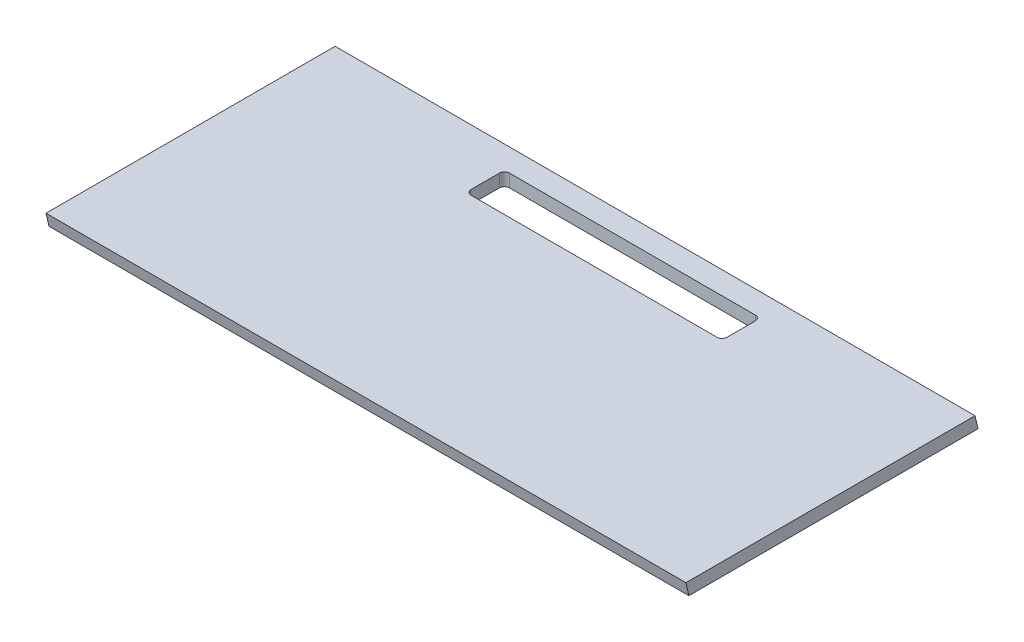
ISO-10303-21;
HEADER;
FILE_DESCRIPTION(('STEP AP214'),'2;1');
FILE_NAME('part.step','',(''),(''),'','','');
FILE_SCHEMA(('AUTOMOTIVE_DESIGN { 1 0 10303 214 1 1 1 1 }'));
ENDSEC;
DATA;
#1=APPLICATION_CONTEXT('core data for automotive mechanical design processes');
#2=APPLICATION_PROTOCOL_DEFINITION('international standard','automotive_design',2000,#1);
#3=PRODUCT_CONTEXT('',#1,'mechanical');
#4=PRODUCT('Part','Part','',(#3));
#5=PRODUCT_RELATED_PRODUCT_CATEGORY('part','',(#4));
#6=PRODUCT_DEFINITION_FORMATION('','',#4);
#7=PRODUCT_DEFINITION_CONTEXT('part definition',#1,'design');
#8=PRODUCT_DEFINITION('design','',#6,#7);
#9=PRODUCT_DEFINITION_SHAPE('','',#8);
#10=(LENGTH_UNIT() NAMED_UNIT(*) SI_UNIT(.MILLI.,.METRE.));
#11=(NAMED_UNIT(*) PLANE_ANGLE_UNIT() SI_UNIT($,.RADIAN.));
#12=(NAMED_UNIT(*) SI_UNIT($,.STERADIAN.) SOLID_ANGLE_UNIT());
#13=UNCERTAINTY_MEASURE_WITH_UNIT(LENGTH_MEASURE(1.E-05),#10,'distance_accuracy_value','');
#14=(GEOMETRIC_REPRESENTATION_CONTEXT(3) GLOBAL_UNCERTAINTY_ASSIGNED_CONTEXT((#13)) GLOBAL_UNIT_ASSIGNED_CONTEXT((#10,
#11,#12)) REPRESENTATION_CONTEXT('',''));
#15=CARTESIAN_POINT('',(0.,0.,0.));
#16=DIRECTION('',(0.,0.,1.));
#17=DIRECTION('',(1.,0.,0.));
#18=AXIS2_PLACEMENT_3D('',#15,#16,#17);
#19=CARTESIAN_POINT('',(250.,10.,114.1));
#20=DIRECTION('',(-1.,0.,0.));
#21=DIRECTION('',(0.,0.,1.));
#22=AXIS2_PLACEMENT_3D('',#19,#20,#21);
#23=PLANE('',#22);
#24=DIRECTION('',(0.,0.,-1.));
#25=VECTOR('',#24,1.);
#26=CARTESIAN_POINT('',(250.,10.,114.1));
#27=LINE('',#26,#25);
#28=CARTESIAN_POINT('',(250.,10.,114.1));
#29=VERTEX_POINT('',#28);
#30=CARTESIAN_POINT('',(250.,10.,-111.791318088744));
#31=VERTEX_POINT('',#30);
#32=EDGE_CURVE('E138',#29,#31,#27,.T.);
#33=ORIENTED_EDGE('',*,*,#32,.F.);
#34=DIRECTION('',(0.,0.974370064785237,0.224951054343859));
#35=VECTOR('',#34,1.);
#36=CARTESIAN_POINT('',(250.,10.,114.1));
#37=LINE('',#36,#35);
#38=CARTESIAN_POINT('',(250.,0.,111.791318088744));
#39=VERTEX_POINT('',#38);
#40=EDGE_CURVE('E125',#39,#29,#37,.T.);
#41=ORIENTED_EDGE('',*,*,#40,.F.);
#42=DIRECTION('',(0.,0.,-1.));
#43=VECTOR('',#42,1.);
#44=CARTESIAN_POINT('',(250.,0.,114.1));
#45=LINE('',#44,#43);
#46=CARTESIAN_POINT('',(250.,0.,-114.1));
#47=VERTEX_POINT('',#46);
#48=EDGE_CURVE('E135',#39,#47,#45,.T.);
#49=ORIENTED_EDGE('',*,*,#48,.T.);
#50=DIRECTION('',(0.,-0.974370064785237,-0.224951054343858));
#51=VECTOR('',#50,1.);
#52=CARTESIAN_POINT('',(250.,0.,-114.1));
#53=LINE('',#52,#51);
#54=EDGE_CURVE('E213',#31,#47,#53,.T.);
#55=ORIENTED_EDGE('',*,*,#54,.F.);
#56=EDGE_LOOP('',(#33,#41,#49,#55));
#57=FACE_BOUND('',#56,.T.);
#58=ADVANCED_FACE('F35',(#57),#23,.F.);
#59=CARTESIAN_POINT('',(-250.,10.,114.1));
#60=DIRECTION('',(1.,0.,0.));
#61=DIRECTION('',(0.,0.,-1.));
#62=AXIS2_PLACEMENT_3D('',#59,#60,#61);
#63=PLANE('',#62);
#64=DIRECTION('',(0.,0.,1.));
#65=VECTOR('',#64,1.);
#66=CARTESIAN_POINT('',(-250.,0.,114.1));
#67=LINE('',#66,#65);
#68=CARTESIAN_POINT('',(-250.,0.,-114.1));
#69=VERTEX_POINT('',#68);
#70=CARTESIAN_POINT('',(-250.,0.,111.791318088744));
#71=VERTEX_POINT('',#70);
#72=EDGE_CURVE('E146',#69,#71,#67,.T.);
#73=ORIENTED_EDGE('',*,*,#72,.T.);
#74=DIRECTION('',(0.,-0.974370064785237,-0.224951054343859));
#75=VECTOR('',#74,1.);
#76=CARTESIAN_POINT('',(-250.,10.,114.1));
#77=LINE('',#76,#75);
#78=CARTESIAN_POINT('',(-250.,10.,114.1));
#79=VERTEX_POINT('',#78);
#80=EDGE_CURVE('E50',#79,#71,#77,.T.);
#81=ORIENTED_EDGE('',*,*,#80,.F.);
#82=DIRECTION('',(0.,0.,1.));
#83=VECTOR('',#82,1.);
#84=CARTESIAN_POINT('',(-250.,10.,114.1));
#85=LINE('',#84,#83);
#86=CARTESIAN_POINT('',(-250.,10.,-111.791318088744));
#87=VERTEX_POINT('',#86);
#88=EDGE_CURVE('E224',#87,#79,#85,.T.);
#89=ORIENTED_EDGE('',*,*,#88,.F.);
#90=DIRECTION('',(0.,0.974370064785237,0.224951054343858));
#91=VECTOR('',#90,1.);
#92=CARTESIAN_POINT('',(-250.,0.,-114.1));
#93=LINE('',#92,#91);
#94=EDGE_CURVE('E231',#69,#87,#93,.T.);
#95=ORIENTED_EDGE('',*,*,#94,.F.);
#96=EDGE_LOOP('',(#73,#81,#89,#95));
#97=FACE_BOUND('',#96,.T.);
#98=ADVANCED_FACE('F229',(#97),#63,.F.);
#99=CARTESIAN_POINT('',(0.,10.,0.));
#100=DIRECTION('',(0.,-1.,0.));
#101=DIRECTION('',(0.,0.,-1.));
#102=AXIS2_PLACEMENT_3D('',#99,#100,#101);
#103=PLANE('',#102);
#104=DIRECTION('',(-1.,0.,0.));
#105=VECTOR('',#104,1.);
#106=CARTESIAN_POINT('',(-100.,10.,-94.1));
#107=LINE('',#106,#105);
#108=CARTESIAN_POINT('',(96.,10.,-94.1));
#109=VERTEX_POINT('',#108);
#110=CARTESIAN_POINT('',(-96.,10.,-94.1));
#111=VERTEX_POINT('',#110);
#112=EDGE_CURVE('E192',#109,#111,#107,.T.);
#113=ORIENTED_EDGE('',*,*,#112,.F.);
#114=CARTESIAN_POINT('',(96.,10.,-90.1));
#115=DIRECTION('',(0.,-1.,0.));
#116=DIRECTION('',(0.,0.,-1.));
#117=AXIS2_PLACEMENT_3D('',#114,#115,#116);
#118=CIRCLE('',#117,4.);
#119=CARTESIAN_POINT('',(100.,10.,-90.1));
#120=VERTEX_POINT('',#119);
#121=EDGE_CURVE('E175',#109,#120,#118,.T.);
#122=ORIENTED_EDGE('',*,*,#121,.T.);
#123=DIRECTION('',(0.,0.,-1.));
#124=VECTOR('',#123,1.);
#125=CARTESIAN_POINT('',(100.,10.,-94.1));
#126=LINE('',#125,#124);
#127=CARTESIAN_POINT('',(100.,10.,-68.1));
#128=VERTEX_POINT('',#127);
#129=EDGE_CURVE('E201',#128,#120,#126,.T.);
#130=ORIENTED_EDGE('',*,*,#129,.F.);
#131=CARTESIAN_POINT('',(96.,10.,-68.1));
#132=DIRECTION('',(0.,-1.,0.));
#133=DIRECTION('',(0.,0.,-1.));
#134=AXIS2_PLACEMENT_3D('',#131,#132,#133);
#135=CIRCLE('',#134,4.);
#136=CARTESIAN_POINT('',(96.,10.,-64.1));
#137=VERTEX_POINT('',#136);
#138=EDGE_CURVE('E179',#128,#137,#135,.T.);
#139=ORIENTED_EDGE('',*,*,#138,.T.);
#140=DIRECTION('',(1.,0.,0.));
#141=VECTOR('',#140,1.);
#142=CARTESIAN_POINT('',(-100.,10.,-64.1));
#143=LINE('',#142,#141);
#144=CARTESIAN_POINT('',(-96.,10.,-64.1));
#145=VERTEX_POINT('',#144);
#146=EDGE_CURVE('E149',#145,#137,#143,.T.);
#147=ORIENTED_EDGE('',*,*,#146,.F.);
#148=CARTESIAN_POINT('',(-96.,10.,-68.1));
#149=DIRECTION('',(0.,-1.,0.));
#150=DIRECTION('',(0.,0.,-1.));
#151=AXIS2_PLACEMENT_3D('',#148,#149,#150);
#152=CIRCLE('',#151,4.);
#153=CARTESIAN_POINT('',(-100.,10.,-68.1));
#154=VERTEX_POINT('',#153);
#155=EDGE_CURVE('E183',#145,#154,#152,.T.);
#156=ORIENTED_EDGE('',*,*,#155,.T.);
#157=DIRECTION('',(0.,0.,1.));
#158=VECTOR('',#157,1.);
#159=CARTESIAN_POINT('',(-100.,10.,-94.1));
#160=LINE('',#159,#158);
#161=CARTESIAN_POINT('',(-100.,10.,-90.1));
#162=VERTEX_POINT('',#161);
#163=EDGE_CURVE('E193',#162,#154,#160,.T.);
#164=ORIENTED_EDGE('',*,*,#163,.F.);
#165=CARTESIAN_POINT('',(-96.,10.,-90.1));
#166=DIRECTION('',(0.,-1.,0.));
#167=DIRECTION('',(0.,0.,-1.));
#168=AXIS2_PLACEMENT_3D('',#165,#166,#167);
#169=CIRCLE('',#168,4.);
#170=EDGE_CURVE('E43',#162,#111,#169,.T.);
#171=ORIENTED_EDGE('',*,*,#170,.T.);
#172=EDGE_LOOP('',(#113,#122,#130,#139,#147,#156,#164,#171));
#173=FACE_BOUND('',#172,.T.);
#174=ORIENTED_EDGE('',*,*,#32,.T.);
#175=DIRECTION('',(1.,0.,0.));
#176=VECTOR('',#175,1.);
#177=CARTESIAN_POINT('',(-250.001,10.,-111.791318088744));
#178=LINE('',#177,#176);
#179=EDGE_CURVE('E209',#87,#31,#178,.T.);
#180=ORIENTED_EDGE('',*,*,#179,.F.);
#181=ORIENTED_EDGE('',*,*,#88,.T.);
#182=DIRECTION('',(1.,0.,0.));
#183=VECTOR('',#182,1.);
#184=CARTESIAN_POINT('',(-250.,10.,114.1));
#185=LINE('',#184,#183);
#186=EDGE_CURVE('E152',#79,#29,#185,.T.);
#187=ORIENTED_EDGE('',*,*,#186,.T.);
#188=EDGE_LOOP('',(#174,#180,#181,#187));
#189=FACE_BOUND('',#188,.T.);
#190=ADVANCED_FACE('F190',(#173,#189),#103,.F.);
#191=CARTESIAN_POINT('',(0.,0.,0.));
#192=DIRECTION('',(0.,-1.,0.));
#193=DIRECTION('',(0.,0.,-1.));
#194=AXIS2_PLACEMENT_3D('',#191,#192,#193);
#195=PLANE('',#194);
#196=DIRECTION('',(1.,0.,0.));
#197=VECTOR('',#196,1.);
#198=CARTESIAN_POINT('',(-250.001,0.,111.791318088744));
#199=LINE('',#198,#197);
#200=EDGE_CURVE('E122',#71,#39,#199,.T.);
#201=ORIENTED_EDGE('',*,*,#200,.F.);
#202=ORIENTED_EDGE('',*,*,#72,.F.);
#203=DIRECTION('',(-1.,0.,0.));
#204=VECTOR('',#203,1.);
#205=CARTESIAN_POINT('',(-250.,0.,-114.1));
#206=LINE('',#205,#204);
#207=EDGE_CURVE('E143',#47,#69,#206,.T.);
#208=ORIENTED_EDGE('',*,*,#207,.F.);
#209=ORIENTED_EDGE('',*,*,#48,.F.);
#210=EDGE_LOOP('',(#201,#202,#208,#209));
#211=FACE_BOUND('',#210,.T.);
#212=DIRECTION('',(1.,0.,0.));
#213=VECTOR('',#212,1.);
#214=CARTESIAN_POINT('',(-100.,0.,-64.1));
#215=LINE('',#214,#213);
#216=CARTESIAN_POINT('',(-96.,0.,-64.1));
#217=VERTEX_POINT('',#216);
#218=CARTESIAN_POINT('',(96.,0.,-64.1));
#219=VERTEX_POINT('',#218);
#220=EDGE_CURVE('E208',#217,#219,#215,.T.);
#221=ORIENTED_EDGE('',*,*,#220,.T.);
#222=CARTESIAN_POINT('',(96.,0.,-68.1));
#223=DIRECTION('',(0.,-1.,0.));
#224=DIRECTION('',(0.,0.,-1.));
#225=AXIS2_PLACEMENT_3D('',#222,#223,#224);
#226=CIRCLE('',#225,4.);
#227=CARTESIAN_POINT('',(100.,0.,-68.1));
#228=VERTEX_POINT('',#227);
#229=EDGE_CURVE('E181',#219,#228,#226,.F.);
#230=ORIENTED_EDGE('',*,*,#229,.T.);
#231=DIRECTION('',(0.,0.,-1.));
#232=VECTOR('',#231,1.);
#233=CARTESIAN_POINT('',(100.,0.,-94.1));
#234=LINE('',#233,#232);
#235=CARTESIAN_POINT('',(100.,0.,-90.1));
#236=VERTEX_POINT('',#235);
#237=EDGE_CURVE('E211',#228,#236,#234,.T.);
#238=ORIENTED_EDGE('',*,*,#237,.T.);
#239=CARTESIAN_POINT('',(96.,0.,-90.1));
#240=DIRECTION('',(0.,-1.,0.));
#241=DIRECTION('',(0.,0.,-1.));
#242=AXIS2_PLACEMENT_3D('',#239,#240,#241);
#243=CIRCLE('',#242,4.);
#244=CARTESIAN_POINT('',(96.,0.,-94.1));
#245=VERTEX_POINT('',#244);
#246=EDGE_CURVE('E177',#236,#245,#243,.F.);
#247=ORIENTED_EDGE('',*,*,#246,.T.);
#248=DIRECTION('',(-1.,0.,0.));
#249=VECTOR('',#248,1.);
#250=CARTESIAN_POINT('',(-100.,0.,-94.1));
#251=LINE('',#250,#249);
#252=CARTESIAN_POINT('',(-96.,0.,-94.1));
#253=VERTEX_POINT('',#252);
#254=EDGE_CURVE('E144',#245,#253,#251,.T.);
#255=ORIENTED_EDGE('',*,*,#254,.T.);
#256=CARTESIAN_POINT('',(-96.,0.,-90.1));
#257=DIRECTION('',(0.,-1.,0.));
#258=DIRECTION('',(0.,0.,-1.));
#259=AXIS2_PLACEMENT_3D('',#256,#257,#258);
#260=CIRCLE('',#259,4.);
#261=CARTESIAN_POINT('',(-100.,0.,-90.1));
#262=VERTEX_POINT('',#261);
#263=EDGE_CURVE('E11',#253,#262,#260,.F.);
#264=ORIENTED_EDGE('',*,*,#263,.T.);
#265=DIRECTION('',(0.,0.,1.));
#266=VECTOR('',#265,1.);
#267=CARTESIAN_POINT('',(-100.,0.,-94.1));
#268=LINE('',#267,#266);
#269=CARTESIAN_POINT('',(-100.,0.,-68.1));
#270=VERTEX_POINT('',#269);
#271=EDGE_CURVE('E205',#262,#270,#268,.T.);
#272=ORIENTED_EDGE('',*,*,#271,.T.);
#273=CARTESIAN_POINT('',(-96.,0.,-68.1));
#274=DIRECTION('',(0.,-1.,0.));
#275=DIRECTION('',(0.,0.,-1.));
#276=AXIS2_PLACEMENT_3D('',#273,#274,#275);
#277=CIRCLE('',#276,4.);
#278=EDGE_CURVE('E185',#270,#217,#277,.F.);
#279=ORIENTED_EDGE('',*,*,#278,.T.);
#280=EDGE_LOOP('',(#221,#230,#238,#247,#255,#264,#272,#279));
#281=FACE_BOUND('',#280,.T.);
#282=ADVANCED_FACE('F141',(#211,#281),#195,.T.);
#283=CARTESIAN_POINT('',(100.,-0.000999999999999265,-94.1));
#284=DIRECTION('',(1.,0.,0.));
#285=DIRECTION('',(0.,0.,-1.));
#286=AXIS2_PLACEMENT_3D('',#283,#284,#285);
#287=PLANE('',#286);
#288=ORIENTED_EDGE('',*,*,#129,.T.);
#289=DIRECTION('',(0.,1.,0.));
#290=VECTOR('',#289,1.);
#291=CARTESIAN_POINT('',(100.,0.,-90.1));
#292=LINE('',#291,#290);
#293=EDGE_CURVE('E164',#120,#236,#292,.F.);
#294=ORIENTED_EDGE('',*,*,#293,.T.);
#295=ORIENTED_EDGE('',*,*,#237,.F.);
#296=DIRECTION('',(0.,1.,0.));
#297=VECTOR('',#296,1.);
#298=CARTESIAN_POINT('',(100.,10.,-68.1));
#299=LINE('',#298,#297);
#300=EDGE_CURVE('E161',#228,#128,#299,.T.);
#301=ORIENTED_EDGE('',*,*,#300,.T.);
#302=EDGE_LOOP('',(#288,#294,#295,#301));
#303=FACE_BOUND('',#302,.T.);
#304=ADVANCED_FACE('F275',(#303),#287,.F.);
#305=CARTESIAN_POINT('',(-100.,-0.000999999999999265,-64.1));
#306=DIRECTION('',(0.,0.,1.));
#307=DIRECTION('',(1.,0.,0.));
#308=AXIS2_PLACEMENT_3D('',#305,#306,#307);
#309=PLANE('',#308);
#310=ORIENTED_EDGE('',*,*,#146,.T.);
#311=DIRECTION('',(0.,1.,0.));
#312=VECTOR('',#311,1.);
#313=CARTESIAN_POINT('',(96.,0.,-64.1));
#314=LINE('',#313,#312);
#315=EDGE_CURVE('E169',#137,#219,#314,.F.);
#316=ORIENTED_EDGE('',*,*,#315,.T.);
#317=ORIENTED_EDGE('',*,*,#220,.F.);
#318=DIRECTION('',(0.,1.,0.));
#319=VECTOR('',#318,1.);
#320=CARTESIAN_POINT('',(-96.,10.,-64.1));
#321=LINE('',#320,#319);
#322=EDGE_CURVE('E166',#217,#145,#321,.T.);
#323=ORIENTED_EDGE('',*,*,#322,.T.);
#324=EDGE_LOOP('',(#310,#316,#317,#323));
#325=FACE_BOUND('',#324,.T.);
#326=ADVANCED_FACE('F268',(#325),#309,.F.);
#327=CARTESIAN_POINT('',(-100.,-0.000999999999999265,-94.1));
#328=DIRECTION('',(-1.,0.,0.));
#329=DIRECTION('',(0.,0.,1.));
#330=AXIS2_PLACEMENT_3D('',#327,#328,#329);
#331=PLANE('',#330);
#332=ORIENTED_EDGE('',*,*,#163,.T.);
#333=DIRECTION('',(0.,1.,0.));
#334=VECTOR('',#333,1.);
#335=CARTESIAN_POINT('',(-100.,0.,-68.1));
#336=LINE('',#335,#334);
#337=EDGE_CURVE('E58',#154,#270,#336,.F.);
#338=ORIENTED_EDGE('',*,*,#337,.T.);
#339=ORIENTED_EDGE('',*,*,#271,.F.);
#340=DIRECTION('',(0.,1.,0.));
#341=VECTOR('',#340,1.);
#342=CARTESIAN_POINT('',(-100.,10.,-90.1));
#343=LINE('',#342,#341);
#344=EDGE_CURVE('E171',#262,#162,#343,.T.);
#345=ORIENTED_EDGE('',*,*,#344,.T.);
#346=EDGE_LOOP('',(#332,#338,#339,#345));
#347=FACE_BOUND('',#346,.T.);
#348=ADVANCED_FACE('F207',(#347),#331,.F.);
#349=CARTESIAN_POINT('',(-100.,-0.000999999999999265,-94.1));
#350=DIRECTION('',(0.,0.,-1.));
#351=DIRECTION('',(-1.,0.,0.));
#352=AXIS2_PLACEMENT_3D('',#349,#350,#351);
#353=PLANE('',#352);
#354=ORIENTED_EDGE('',*,*,#254,.F.);
#355=DIRECTION('',(0.,1.,0.));
#356=VECTOR('',#355,1.);
#357=CARTESIAN_POINT('',(96.,10.,-94.1));
#358=LINE('',#357,#356);
#359=EDGE_CURVE('E158',#245,#109,#358,.T.);
#360=ORIENTED_EDGE('',*,*,#359,.T.);
#361=ORIENTED_EDGE('',*,*,#112,.T.);
#362=DIRECTION('',(0.,1.,0.));
#363=VECTOR('',#362,1.);
#364=CARTESIAN_POINT('',(-96.,0.,-94.1));
#365=LINE('',#364,#363);
#366=EDGE_CURVE('E156',#111,#253,#365,.F.);
#367=ORIENTED_EDGE('',*,*,#366,.T.);
#368=EDGE_LOOP('',(#354,#360,#361,#367));
#369=FACE_BOUND('',#368,.T.);
#370=ADVANCED_FACE('F199',(#369),#353,.F.);
#371=CARTESIAN_POINT('',(96.,-0.000999999999999265,-90.1));
#372=DIRECTION('',(0.,-1.,0.));
#373=DIRECTION('',(0.,0.,-1.));
#374=AXIS2_PLACEMENT_3D('',#371,#372,#373);
#375=CYLINDRICAL_SURFACE('',#374,4.);
#376=ORIENTED_EDGE('',*,*,#246,.F.);
#377=ORIENTED_EDGE('',*,*,#293,.F.);
#378=ORIENTED_EDGE('',*,*,#121,.F.);
#379=ORIENTED_EDGE('',*,*,#359,.F.);
#380=EDGE_LOOP('',(#376,#377,#378,#379));
#381=FACE_BOUND('',#380,.T.);
#382=ADVANCED_FACE('F253',(#381),#375,.F.);
#383=CARTESIAN_POINT('',(96.,-0.000999999999999265,-68.1));
#384=DIRECTION('',(0.,-1.,0.));
#385=DIRECTION('',(0.,0.,-1.));
#386=AXIS2_PLACEMENT_3D('',#383,#384,#385);
#387=CYLINDRICAL_SURFACE('',#386,4.);
#388=ORIENTED_EDGE('',*,*,#229,.F.);
#389=ORIENTED_EDGE('',*,*,#315,.F.);
#390=ORIENTED_EDGE('',*,*,#138,.F.);
#391=ORIENTED_EDGE('',*,*,#300,.F.);
#392=EDGE_LOOP('',(#388,#389,#390,#391));
#393=FACE_BOUND('',#392,.T.);
#394=ADVANCED_FACE('F256',(#393),#387,.F.);
#395=CARTESIAN_POINT('',(-96.,-0.000999999999999265,-68.1));
#396=DIRECTION('',(0.,-1.,0.));
#397=DIRECTION('',(0.,0.,-1.));
#398=AXIS2_PLACEMENT_3D('',#395,#396,#397);
#399=CYLINDRICAL_SURFACE('',#398,4.);
#400=ORIENTED_EDGE('',*,*,#278,.F.);
#401=ORIENTED_EDGE('',*,*,#337,.F.);
#402=ORIENTED_EDGE('',*,*,#155,.F.);
#403=ORIENTED_EDGE('',*,*,#322,.F.);
#404=EDGE_LOOP('',(#400,#401,#402,#403));
#405=FACE_BOUND('',#404,.T.);
#406=ADVANCED_FACE('F243',(#405),#399,.F.);
#407=CARTESIAN_POINT('',(-96.,-0.000999999999999265,-90.1));
#408=DIRECTION('',(0.,-1.,0.));
#409=DIRECTION('',(0.,0.,-1.));
#410=AXIS2_PLACEMENT_3D('',#407,#408,#409);
#411=CYLINDRICAL_SURFACE('',#410,4.);
#412=ORIENTED_EDGE('',*,*,#263,.F.);
#413=ORIENTED_EDGE('',*,*,#366,.F.);
#414=ORIENTED_EDGE('',*,*,#170,.F.);
#415=ORIENTED_EDGE('',*,*,#344,.F.);
#416=EDGE_LOOP('',(#412,#413,#414,#415));
#417=FACE_BOUND('',#416,.T.);
#418=ADVANCED_FACE('F37',(#417),#411,.F.);
#419=CARTESIAN_POINT('',(-250.001,0.,-114.1));
#420=DIRECTION('',(0.,-0.224951054343858,0.974370064785237));
#421=DIRECTION('',(0.,-0.974370064785237,-0.224951054343858));
#422=AXIS2_PLACEMENT_3D('',#419,#420,#421);
#423=PLANE('',#422);
#424=ORIENTED_EDGE('',*,*,#94,.T.);
#425=ORIENTED_EDGE('',*,*,#179,.T.);
#426=ORIENTED_EDGE('',*,*,#54,.T.);
#427=ORIENTED_EDGE('',*,*,#207,.T.);
#428=EDGE_LOOP('',(#424,#425,#426,#427));
#429=FACE_BOUND('',#428,.T.);
#430=ADVANCED_FACE('F235',(#429),#423,.F.);
#431=CARTESIAN_POINT('',(-250.001,10.,114.1));
#432=DIRECTION('',(0.,0.224951054343859,-0.974370064785237));
#433=DIRECTION('',(0.,0.974370064785237,0.224951054343859));
#434=AXIS2_PLACEMENT_3D('',#431,#432,#433);
#435=PLANE('',#434);
#436=ORIENTED_EDGE('',*,*,#80,.T.);
#437=ORIENTED_EDGE('',*,*,#200,.T.);
#438=ORIENTED_EDGE('',*,*,#40,.T.);
#439=ORIENTED_EDGE('',*,*,#186,.F.);
#440=EDGE_LOOP('',(#436,#437,#438,#439));
#441=FACE_BOUND('',#440,.T.);
#442=ADVANCED_FACE('F124',(#441),#435,.F.);
#443=CLOSED_SHELL('',(#58,#98,#190,#282,#304,#326,#348,#370,#382,#394,#406,#418,#430,#442));
#444=MANIFOLD_SOLID_BREP('B2',#443);
#445=ADVANCED_BREP_SHAPE_REPRESENTATION('',(#18,#444),#14);
#446=SHAPE_DEFINITION_REPRESENTATION(#9,#445);
ENDSEC;
END-ISO-10303-21;
